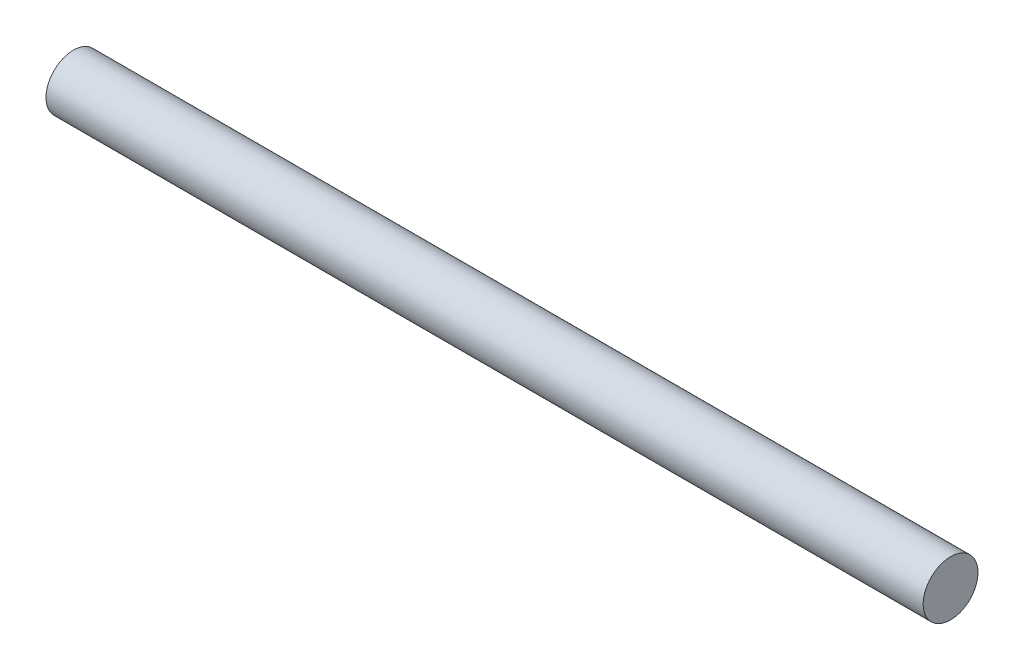
ISO-10303-21;
HEADER;
FILE_DESCRIPTION(('STEP AP214'),'2;1');
FILE_NAME('part.step','',(''),(''),'','','');
FILE_SCHEMA(('AUTOMOTIVE_DESIGN { 1 0 10303 214 1 1 1 1 }'));
ENDSEC;
DATA;
#1=APPLICATION_CONTEXT('core data for automotive mechanical design processes');
#2=APPLICATION_PROTOCOL_DEFINITION('international standard','automotive_design',2000,#1);
#3=PRODUCT_CONTEXT('',#1,'mechanical');
#4=PRODUCT('Part','Part','',(#3));
#5=PRODUCT_RELATED_PRODUCT_CATEGORY('part','',(#4));
#6=PRODUCT_DEFINITION_FORMATION('','',#4);
#7=PRODUCT_DEFINITION_CONTEXT('part definition',#1,'design');
#8=PRODUCT_DEFINITION('design','',#6,#7);
#9=PRODUCT_DEFINITION_SHAPE('','',#8);
#10=(LENGTH_UNIT() NAMED_UNIT(*) SI_UNIT(.MILLI.,.METRE.));
#11=(NAMED_UNIT(*) PLANE_ANGLE_UNIT() SI_UNIT($,.RADIAN.));
#12=(NAMED_UNIT(*) SI_UNIT($,.STERADIAN.) SOLID_ANGLE_UNIT());
#13=UNCERTAINTY_MEASURE_WITH_UNIT(LENGTH_MEASURE(1.E-05),#10,'distance_accuracy_value','');
#14=(GEOMETRIC_REPRESENTATION_CONTEXT(3) GLOBAL_UNCERTAINTY_ASSIGNED_CONTEXT((#13)) GLOBAL_UNIT_ASSIGNED_CONTEXT((#10,
#11,#12)) REPRESENTATION_CONTEXT('',''));
#15=CARTESIAN_POINT('',(0.,0.,0.));
#16=DIRECTION('',(0.,0.,1.));
#17=DIRECTION('',(1.,0.,0.));
#18=AXIS2_PLACEMENT_3D('',#15,#16,#17);
#19=CARTESIAN_POINT('',(101.6,0.,0.));
#20=DIRECTION('',(-1.,0.,0.));
#21=DIRECTION('',(0.,0.,1.));
#22=AXIS2_PLACEMENT_3D('',#19,#20,#21);
#23=CYLINDRICAL_SURFACE('',#22,3.175);
#24=CARTESIAN_POINT('',(101.6,0.,0.));
#25=DIRECTION('',(1.,0.,0.));
#26=DIRECTION('',(0.,0.,-1.));
#27=AXIS2_PLACEMENT_3D('',#24,#25,#26);
#28=CIRCLE('',#27,3.175);
#29=CARTESIAN_POINT('',(101.6,0.,-3.175));
#30=VERTEX_POINT('',#29);
#31=EDGE_CURVE('E10',#30,#30,#28,.T.);
#32=ORIENTED_EDGE('',*,*,#31,.F.);
#33=EDGE_LOOP('',(#32));
#34=FACE_BOUND('',#33,.T.);
#35=CARTESIAN_POINT('',(0.,0.,0.));
#36=DIRECTION('',(1.,0.,0.));
#37=DIRECTION('',(0.,0.,-1.));
#38=AXIS2_PLACEMENT_3D('',#35,#36,#37);
#39=CIRCLE('',#38,3.175);
#40=CARTESIAN_POINT('',(0.,0.,-3.175));
#41=VERTEX_POINT('',#40);
#42=EDGE_CURVE('E34',#41,#41,#39,.T.);
#43=ORIENTED_EDGE('',*,*,#42,.T.);
#44=EDGE_LOOP('',(#43));
#45=FACE_BOUND('',#44,.T.);
#46=ADVANCED_FACE('F31',(#34,#45),#23,.T.);
#47=CARTESIAN_POINT('',(101.6,0.,0.));
#48=DIRECTION('',(1.,0.,0.));
#49=DIRECTION('',(0.,0.,-1.));
#50=AXIS2_PLACEMENT_3D('',#47,#48,#49);
#51=PLANE('',#50);
#52=ORIENTED_EDGE('',*,*,#31,.T.);
#53=EDGE_LOOP('',(#52));
#54=FACE_BOUND('',#53,.T.);
#55=ADVANCED_FACE('F46',(#54),#51,.T.);
#56=CARTESIAN_POINT('',(0.,0.,0.));
#57=DIRECTION('',(1.,0.,0.));
#58=DIRECTION('',(0.,0.,-1.));
#59=AXIS2_PLACEMENT_3D('',#56,#57,#58);
#60=PLANE('',#59);
#61=ORIENTED_EDGE('',*,*,#42,.F.);
#62=EDGE_LOOP('',(#61));
#63=FACE_BOUND('',#62,.T.);
#64=ADVANCED_FACE('F44',(#63),#60,.F.);
#65=CLOSED_SHELL('',(#46,#55,#64));
#66=MANIFOLD_SOLID_BREP('B2',#65);
#67=ADVANCED_BREP_SHAPE_REPRESENTATION('',(#18,#66),#14);
#68=SHAPE_DEFINITION_REPRESENTATION(#9,#67);
ENDSEC;
END-ISO-10303-21;
